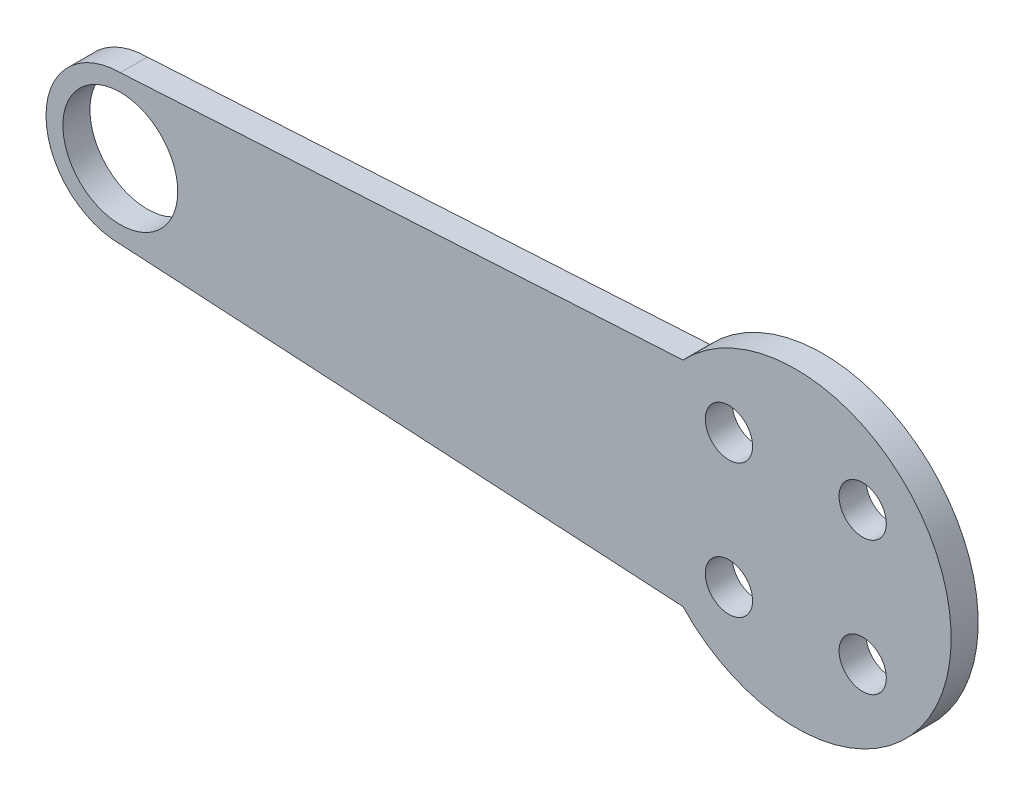
ISO-10303-21;
HEADER;
FILE_DESCRIPTION(('STEP AP214'),'2;1');
FILE_NAME('part.step','',(''),(''),'','','');
FILE_SCHEMA(('AUTOMOTIVE_DESIGN { 1 0 10303 214 1 1 1 1 }'));
ENDSEC;
DATA;
#1=APPLICATION_CONTEXT('core data for automotive mechanical design processes');
#2=APPLICATION_PROTOCOL_DEFINITION('international standard','automotive_design',2000,#1);
#3=PRODUCT_CONTEXT('',#1,'mechanical');
#4=PRODUCT('Part','Part','',(#3));
#5=PRODUCT_RELATED_PRODUCT_CATEGORY('part','',(#4));
#6=PRODUCT_DEFINITION_FORMATION('','',#4);
#7=PRODUCT_DEFINITION_CONTEXT('part definition',#1,'design');
#8=PRODUCT_DEFINITION('design','',#6,#7);
#9=PRODUCT_DEFINITION_SHAPE('','',#8);
#10=(LENGTH_UNIT() NAMED_UNIT(*) SI_UNIT(.MILLI.,.METRE.));
#11=(NAMED_UNIT(*) PLANE_ANGLE_UNIT() SI_UNIT($,.RADIAN.));
#12=(NAMED_UNIT(*) SI_UNIT($,.STERADIAN.) SOLID_ANGLE_UNIT());
#13=UNCERTAINTY_MEASURE_WITH_UNIT(LENGTH_MEASURE(1.E-05),#10,'distance_accuracy_value','');
#14=(GEOMETRIC_REPRESENTATION_CONTEXT(3) GLOBAL_UNCERTAINTY_ASSIGNED_CONTEXT((#13)) GLOBAL_UNIT_ASSIGNED_CONTEXT((#10,
#11,#12)) REPRESENTATION_CONTEXT('',''));
#15=CARTESIAN_POINT('',(0.,0.,0.));
#16=DIRECTION('',(0.,0.,1.));
#17=DIRECTION('',(1.,0.,0.));
#18=AXIS2_PLACEMENT_3D('',#15,#16,#17);
#19=CARTESIAN_POINT('',(-50.,0.,2.));
#20=DIRECTION('',(0.,0.,1.));
#21=DIRECTION('',(1.,0.,0.));
#22=AXIS2_PLACEMENT_3D('',#19,#20,#21);
#23=PLANE('',#22);
#24=CARTESIAN_POINT('',(4.94974746830582,-4.94974746830585,2.));
#25=DIRECTION('',(0.,0.,1.));
#26=DIRECTION('',(1.,0.,0.));
#27=AXIS2_PLACEMENT_3D('',#24,#25,#26);
#28=CIRCLE('',#27,1.75);
#29=CARTESIAN_POINT('',(6.69974746830582,-4.94974746830585,2.));
#30=VERTEX_POINT('',#29);
#31=EDGE_CURVE('E203',#30,#30,#28,.T.);
#32=ORIENTED_EDGE('',*,*,#31,.F.);
#33=EDGE_LOOP('',(#32));
#34=FACE_BOUND('',#33,.T.);
#35=CARTESIAN_POINT('',(4.94974746830583,4.94974746830583,2.));
#36=DIRECTION('',(0.,0.,1.));
#37=DIRECTION('',(1.,0.,0.));
#38=AXIS2_PLACEMENT_3D('',#35,#36,#37);
#39=CIRCLE('',#38,1.75);
#40=CARTESIAN_POINT('',(6.69974746830583,4.94974746830583,2.));
#41=VERTEX_POINT('',#40);
#42=EDGE_CURVE('E191',#41,#41,#39,.T.);
#43=ORIENTED_EDGE('',*,*,#42,.F.);
#44=EDGE_LOOP('',(#43));
#45=FACE_BOUND('',#44,.T.);
#46=CARTESIAN_POINT('',(-50.,0.,2.));
#47=DIRECTION('',(0.,0.,1.));
#48=DIRECTION('',(1.,0.,0.));
#49=AXIS2_PLACEMENT_3D('',#46,#47,#48);
#50=CIRCLE('',#49,5.5);
#51=CARTESIAN_POINT('',(-50.,5.49999999999999,2.));
#52=VERTEX_POINT('',#51);
#53=CARTESIAN_POINT('',(-50.,-5.50000000000001,2.));
#54=VERTEX_POINT('',#53);
#55=EDGE_CURVE('E162',#52,#54,#50,.T.);
#56=ORIENTED_EDGE('',*,*,#55,.T.);
#57=DIRECTION('',(0.998339711761799,-0.0576005201310613,0.));
#58=VECTOR('',#57,1.);
#59=CARTESIAN_POINT('',(-50.,-5.50000000000001,2.));
#60=LINE('',#59,#58);
#61=CARTESIAN_POINT('',(-8.35438679497923,-7.90279831957496,2.));
#62=VERTEX_POINT('',#61);
#63=EDGE_CURVE('E155',#54,#62,#60,.T.);
#64=ORIENTED_EDGE('',*,*,#63,.T.);
#65=CARTESIAN_POINT('',(0.,0.,2.));
#66=DIRECTION('',(0.,0.,1.));
#67=DIRECTION('',(1.,0.,0.));
#68=AXIS2_PLACEMENT_3D('',#65,#66,#67);
#69=CIRCLE('',#68,11.5);
#70=CARTESIAN_POINT('',(-8.35438679497923,7.90279831957495,2.));
#71=VERTEX_POINT('',#70);
#72=EDGE_CURVE('E161',#62,#71,#69,.T.);
#73=ORIENTED_EDGE('',*,*,#72,.T.);
#74=DIRECTION('',(0.998339711761799,0.0576005201310615,0.));
#75=VECTOR('',#74,1.);
#76=CARTESIAN_POINT('',(-50.,5.49999999999999,2.));
#77=LINE('',#76,#75);
#78=EDGE_CURVE('E171',#52,#71,#77,.T.);
#79=ORIENTED_EDGE('',*,*,#78,.F.);
#80=EDGE_LOOP('',(#56,#64,#73,#79));
#81=FACE_BOUND('',#80,.T.);
#82=CARTESIAN_POINT('',(-50.,0.,2.));
#83=DIRECTION('',(0.,0.,1.));
#84=DIRECTION('',(1.,0.,0.));
#85=AXIS2_PLACEMENT_3D('',#82,#83,#84);
#86=CIRCLE('',#85,4.25000000000001);
#87=CARTESIAN_POINT('',(-45.75,0.,2.));
#88=VERTEX_POINT('',#87);
#89=EDGE_CURVE('E178',#88,#88,#86,.T.);
#90=ORIENTED_EDGE('',*,*,#89,.F.);
#91=EDGE_LOOP('',(#90));
#92=FACE_BOUND('',#91,.T.);
#93=CARTESIAN_POINT('',(-4.94974746830578,4.94974746830588,2.));
#94=DIRECTION('',(0.,0.,1.));
#95=DIRECTION('',(1.,0.,0.));
#96=AXIS2_PLACEMENT_3D('',#93,#94,#95);
#97=CIRCLE('',#96,1.75);
#98=CARTESIAN_POINT('',(-3.19974746830578,4.94974746830588,2.));
#99=VERTEX_POINT('',#98);
#100=EDGE_CURVE('E197',#99,#99,#97,.T.);
#101=ORIENTED_EDGE('',*,*,#100,.F.);
#102=EDGE_LOOP('',(#101));
#103=FACE_BOUND('',#102,.T.);
#104=CARTESIAN_POINT('',(-4.94974746830528,-4.94974746830639,2.));
#105=DIRECTION('',(0.,0.,1.));
#106=DIRECTION('',(1.,0.,0.));
#107=AXIS2_PLACEMENT_3D('',#104,#105,#106);
#108=CIRCLE('',#107,1.75000000000039);
#109=CARTESIAN_POINT('',(-3.19974746830488,-4.94974746830639,2.));
#110=VERTEX_POINT('',#109);
#111=EDGE_CURVE('E209',#110,#110,#108,.T.);
#112=ORIENTED_EDGE('',*,*,#111,.F.);
#113=EDGE_LOOP('',(#112));
#114=FACE_BOUND('',#113,.T.);
#115=ADVANCED_FACE('F112',(#34,#45,#81,#92,#103,#114),#23,.T.);
#116=CARTESIAN_POINT('',(-50.,0.,0.));
#117=DIRECTION('',(0.,0.,1.));
#118=DIRECTION('',(1.,0.,0.));
#119=AXIS2_PLACEMENT_3D('',#116,#117,#118);
#120=PLANE('',#119);
#121=CARTESIAN_POINT('',(-50.,0.,0.));
#122=DIRECTION('',(0.,0.,1.));
#123=DIRECTION('',(1.,0.,0.));
#124=AXIS2_PLACEMENT_3D('',#121,#122,#123);
#125=CIRCLE('',#124,5.5);
#126=CARTESIAN_POINT('',(-50.,5.49999999999999,0.));
#127=VERTEX_POINT('',#126);
#128=CARTESIAN_POINT('',(-50.,-5.50000000000001,0.));
#129=VERTEX_POINT('',#128);
#130=EDGE_CURVE('E176',#127,#129,#125,.T.);
#131=ORIENTED_EDGE('',*,*,#130,.F.);
#132=DIRECTION('',(0.998339711761799,0.0576005201310615,0.));
#133=VECTOR('',#132,1.);
#134=CARTESIAN_POINT('',(-50.,5.49999999999999,0.));
#135=LINE('',#134,#133);
#136=CARTESIAN_POINT('',(-8.35438679497923,7.90279831957495,0.));
#137=VERTEX_POINT('',#136);
#138=EDGE_CURVE('E182',#127,#137,#135,.T.);
#139=ORIENTED_EDGE('',*,*,#138,.T.);
#140=CARTESIAN_POINT('',(0.,0.,0.));
#141=DIRECTION('',(0.,0.,1.));
#142=DIRECTION('',(1.,0.,0.));
#143=AXIS2_PLACEMENT_3D('',#140,#141,#142);
#144=CIRCLE('',#143,11.5);
#145=CARTESIAN_POINT('',(-8.35438679497923,-7.90279831957496,0.));
#146=VERTEX_POINT('',#145);
#147=EDGE_CURVE('E180',#146,#137,#144,.T.);
#148=ORIENTED_EDGE('',*,*,#147,.F.);
#149=DIRECTION('',(0.998339711761799,-0.0576005201310613,0.));
#150=VECTOR('',#149,1.);
#151=CARTESIAN_POINT('',(-50.,-5.50000000000001,0.));
#152=LINE('',#151,#150);
#153=EDGE_CURVE('E167',#129,#146,#152,.T.);
#154=ORIENTED_EDGE('',*,*,#153,.F.);
#155=EDGE_LOOP('',(#131,#139,#148,#154));
#156=FACE_BOUND('',#155,.T.);
#157=CARTESIAN_POINT('',(-50.,0.,0.));
#158=DIRECTION('',(0.,0.,1.));
#159=DIRECTION('',(1.,0.,0.));
#160=AXIS2_PLACEMENT_3D('',#157,#158,#159);
#161=CIRCLE('',#160,4.25000000000001);
#162=CARTESIAN_POINT('',(-45.75,0.,0.));
#163=VERTEX_POINT('',#162);
#164=EDGE_CURVE('E188',#163,#163,#161,.T.);
#165=ORIENTED_EDGE('',*,*,#164,.T.);
#166=EDGE_LOOP('',(#165));
#167=FACE_BOUND('',#166,.T.);
#168=CARTESIAN_POINT('',(4.94974746830583,4.94974746830583,0.));
#169=DIRECTION('',(0.,0.,1.));
#170=DIRECTION('',(1.,0.,0.));
#171=AXIS2_PLACEMENT_3D('',#168,#169,#170);
#172=CIRCLE('',#171,1.75);
#173=CARTESIAN_POINT('',(6.69974746830583,4.94974746830583,0.));
#174=VERTEX_POINT('',#173);
#175=EDGE_CURVE('E194',#174,#174,#172,.T.);
#176=ORIENTED_EDGE('',*,*,#175,.T.);
#177=EDGE_LOOP('',(#176));
#178=FACE_BOUND('',#177,.T.);
#179=CARTESIAN_POINT('',(-4.94974746830578,4.94974746830588,0.));
#180=DIRECTION('',(0.,0.,1.));
#181=DIRECTION('',(1.,0.,0.));
#182=AXIS2_PLACEMENT_3D('',#179,#180,#181);
#183=CIRCLE('',#182,1.75);
#184=CARTESIAN_POINT('',(-3.19974746830578,4.94974746830588,0.));
#185=VERTEX_POINT('',#184);
#186=EDGE_CURVE('E200',#185,#185,#183,.T.);
#187=ORIENTED_EDGE('',*,*,#186,.T.);
#188=EDGE_LOOP('',(#187));
#189=FACE_BOUND('',#188,.T.);
#190=CARTESIAN_POINT('',(4.94974746830582,-4.94974746830585,0.));
#191=DIRECTION('',(0.,0.,1.));
#192=DIRECTION('',(1.,0.,0.));
#193=AXIS2_PLACEMENT_3D('',#190,#191,#192);
#194=CIRCLE('',#193,1.75);
#195=CARTESIAN_POINT('',(6.69974746830582,-4.94974746830585,0.));
#196=VERTEX_POINT('',#195);
#197=EDGE_CURVE('E206',#196,#196,#194,.T.);
#198=ORIENTED_EDGE('',*,*,#197,.T.);
#199=EDGE_LOOP('',(#198));
#200=FACE_BOUND('',#199,.T.);
#201=CARTESIAN_POINT('',(-4.94974746830528,-4.94974746830639,0.));
#202=DIRECTION('',(0.,0.,1.));
#203=DIRECTION('',(1.,0.,0.));
#204=AXIS2_PLACEMENT_3D('',#201,#202,#203);
#205=CIRCLE('',#204,1.75000000000039);
#206=CARTESIAN_POINT('',(-3.19974746830488,-4.94974746830639,0.));
#207=VERTEX_POINT('',#206);
#208=EDGE_CURVE('E212',#207,#207,#205,.T.);
#209=ORIENTED_EDGE('',*,*,#208,.T.);
#210=EDGE_LOOP('',(#209));
#211=FACE_BOUND('',#210,.T.);
#212=ADVANCED_FACE('F222',(#156,#167,#178,#189,#200,#211),#120,.F.);
#213=CARTESIAN_POINT('',(-50.,0.,2.));
#214=DIRECTION('',(0.,0.,-1.));
#215=DIRECTION('',(-1.,0.,0.));
#216=AXIS2_PLACEMENT_3D('',#213,#214,#215);
#217=CYLINDRICAL_SURFACE('',#216,5.5);
#218=ORIENTED_EDGE('',*,*,#130,.T.);
#219=DIRECTION('',(0.,0.,-1.));
#220=VECTOR('',#219,1.);
#221=CARTESIAN_POINT('',(-50.,-5.50000000000001,2.));
#222=LINE('',#221,#220);
#223=EDGE_CURVE('E12',#54,#129,#222,.T.);
#224=ORIENTED_EDGE('',*,*,#223,.F.);
#225=ORIENTED_EDGE('',*,*,#55,.F.);
#226=DIRECTION('',(0.,0.,-1.));
#227=VECTOR('',#226,1.);
#228=CARTESIAN_POINT('',(-50.,5.49999999999999,2.));
#229=LINE('',#228,#227);
#230=EDGE_CURVE('E129',#52,#127,#229,.T.);
#231=ORIENTED_EDGE('',*,*,#230,.T.);
#232=EDGE_LOOP('',(#218,#224,#225,#231));
#233=FACE_BOUND('',#232,.T.);
#234=ADVANCED_FACE('F114',(#233),#217,.T.);
#235=CARTESIAN_POINT('',(-50.,-5.50000000000001,2.));
#236=DIRECTION('',(0.0576005201310613,0.998339711761799,0.));
#237=DIRECTION('',(-0.998339711761799,0.0576005201310613,0.));
#238=AXIS2_PLACEMENT_3D('',#235,#236,#237);
#239=PLANE('',#238);
#240=ORIENTED_EDGE('',*,*,#153,.T.);
#241=DIRECTION('',(0.,0.,-1.));
#242=VECTOR('',#241,1.);
#243=CARTESIAN_POINT('',(-8.35438679497923,-7.90279831957496,2.));
#244=LINE('',#243,#242);
#245=EDGE_CURVE('E121',#62,#146,#244,.T.);
#246=ORIENTED_EDGE('',*,*,#245,.F.);
#247=ORIENTED_EDGE('',*,*,#63,.F.);
#248=ORIENTED_EDGE('',*,*,#223,.T.);
#249=EDGE_LOOP('',(#240,#246,#247,#248));
#250=FACE_BOUND('',#249,.T.);
#251=ADVANCED_FACE('F166',(#250),#239,.F.);
#252=CARTESIAN_POINT('',(0.,0.,2.));
#253=DIRECTION('',(0.,0.,-1.));
#254=DIRECTION('',(-1.,0.,0.));
#255=AXIS2_PLACEMENT_3D('',#252,#253,#254);
#256=CYLINDRICAL_SURFACE('',#255,11.5);
#257=ORIENTED_EDGE('',*,*,#147,.T.);
#258=DIRECTION('',(0.,0.,-1.));
#259=VECTOR('',#258,1.);
#260=CARTESIAN_POINT('',(-8.35438679497923,7.90279831957495,2.));
#261=LINE('',#260,#259);
#262=EDGE_CURVE('E144',#71,#137,#261,.T.);
#263=ORIENTED_EDGE('',*,*,#262,.F.);
#264=ORIENTED_EDGE('',*,*,#72,.F.);
#265=ORIENTED_EDGE('',*,*,#245,.T.);
#266=EDGE_LOOP('',(#257,#263,#264,#265));
#267=FACE_BOUND('',#266,.T.);
#268=ADVANCED_FACE('F170',(#267),#256,.T.);
#269=CARTESIAN_POINT('',(-50.,5.49999999999999,2.));
#270=DIRECTION('',(-0.0576005201310615,0.998339711761799,0.));
#271=DIRECTION('',(-0.998339711761799,-0.0576005201310615,0.));
#272=AXIS2_PLACEMENT_3D('',#269,#270,#271);
#273=PLANE('',#272);
#274=ORIENTED_EDGE('',*,*,#138,.F.);
#275=ORIENTED_EDGE('',*,*,#230,.F.);
#276=ORIENTED_EDGE('',*,*,#78,.T.);
#277=ORIENTED_EDGE('',*,*,#262,.T.);
#278=EDGE_LOOP('',(#274,#275,#276,#277));
#279=FACE_BOUND('',#278,.T.);
#280=ADVANCED_FACE('F235',(#279),#273,.T.);
#281=CARTESIAN_POINT('',(-50.,0.,2.));
#282=DIRECTION('',(0.,0.,-1.));
#283=DIRECTION('',(-1.,0.,0.));
#284=AXIS2_PLACEMENT_3D('',#281,#282,#283);
#285=CYLINDRICAL_SURFACE('',#284,4.25000000000001);
#286=ORIENTED_EDGE('',*,*,#89,.T.);
#287=EDGE_LOOP('',(#286));
#288=FACE_BOUND('',#287,.T.);
#289=ORIENTED_EDGE('',*,*,#164,.F.);
#290=EDGE_LOOP('',(#289));
#291=FACE_BOUND('',#290,.T.);
#292=ADVANCED_FACE('F232',(#288,#291),#285,.F.);
#293=CARTESIAN_POINT('',(4.94974746830583,4.94974746830583,2.));
#294=DIRECTION('',(0.,0.,-1.));
#295=DIRECTION('',(-1.,0.,0.));
#296=AXIS2_PLACEMENT_3D('',#293,#294,#295);
#297=CYLINDRICAL_SURFACE('',#296,1.75);
#298=ORIENTED_EDGE('',*,*,#42,.T.);
#299=EDGE_LOOP('',(#298));
#300=FACE_BOUND('',#299,.T.);
#301=ORIENTED_EDGE('',*,*,#175,.F.);
#302=EDGE_LOOP('',(#301));
#303=FACE_BOUND('',#302,.T.);
#304=ADVANCED_FACE('F266',(#300,#303),#297,.F.);
#305=CARTESIAN_POINT('',(-4.94974746830578,4.94974746830588,2.));
#306=DIRECTION('',(0.,0.,-1.));
#307=DIRECTION('',(-1.,0.,0.));
#308=AXIS2_PLACEMENT_3D('',#305,#306,#307);
#309=CYLINDRICAL_SURFACE('',#308,1.75);
#310=ORIENTED_EDGE('',*,*,#100,.T.);
#311=EDGE_LOOP('',(#310));
#312=FACE_BOUND('',#311,.T.);
#313=ORIENTED_EDGE('',*,*,#186,.F.);
#314=EDGE_LOOP('',(#313));
#315=FACE_BOUND('',#314,.T.);
#316=ADVANCED_FACE('F261',(#312,#315),#309,.F.);
#317=CARTESIAN_POINT('',(4.94974746830582,-4.94974746830585,2.));
#318=DIRECTION('',(0.,0.,-1.));
#319=DIRECTION('',(-1.,0.,0.));
#320=AXIS2_PLACEMENT_3D('',#317,#318,#319);
#321=CYLINDRICAL_SURFACE('',#320,1.75);
#322=ORIENTED_EDGE('',*,*,#31,.T.);
#323=EDGE_LOOP('',(#322));
#324=FACE_BOUND('',#323,.T.);
#325=ORIENTED_EDGE('',*,*,#197,.F.);
#326=EDGE_LOOP('',(#325));
#327=FACE_BOUND('',#326,.T.);
#328=ADVANCED_FACE('F256',(#324,#327),#321,.F.);
#329=CARTESIAN_POINT('',(-4.94974746830528,-4.94974746830639,2.));
#330=DIRECTION('',(0.,0.,-1.));
#331=DIRECTION('',(-1.,0.,0.));
#332=AXIS2_PLACEMENT_3D('',#329,#330,#331);
#333=CYLINDRICAL_SURFACE('',#332,1.75000000000039);
#334=ORIENTED_EDGE('',*,*,#111,.T.);
#335=EDGE_LOOP('',(#334));
#336=FACE_BOUND('',#335,.T.);
#337=ORIENTED_EDGE('',*,*,#208,.F.);
#338=EDGE_LOOP('',(#337));
#339=FACE_BOUND('',#338,.T.);
#340=ADVANCED_FACE('F218',(#336,#339),#333,.F.);
#341=CLOSED_SHELL('',(#115,#212,#234,#251,#268,#280,#292,#304,#316,#328,#340));
#342=MANIFOLD_SOLID_BREP('B2',#341);
#343=ADVANCED_BREP_SHAPE_REPRESENTATION('',(#18,#342),#14);
#344=SHAPE_DEFINITION_REPRESENTATION(#9,#343);
ENDSEC;
END-ISO-10303-21;
